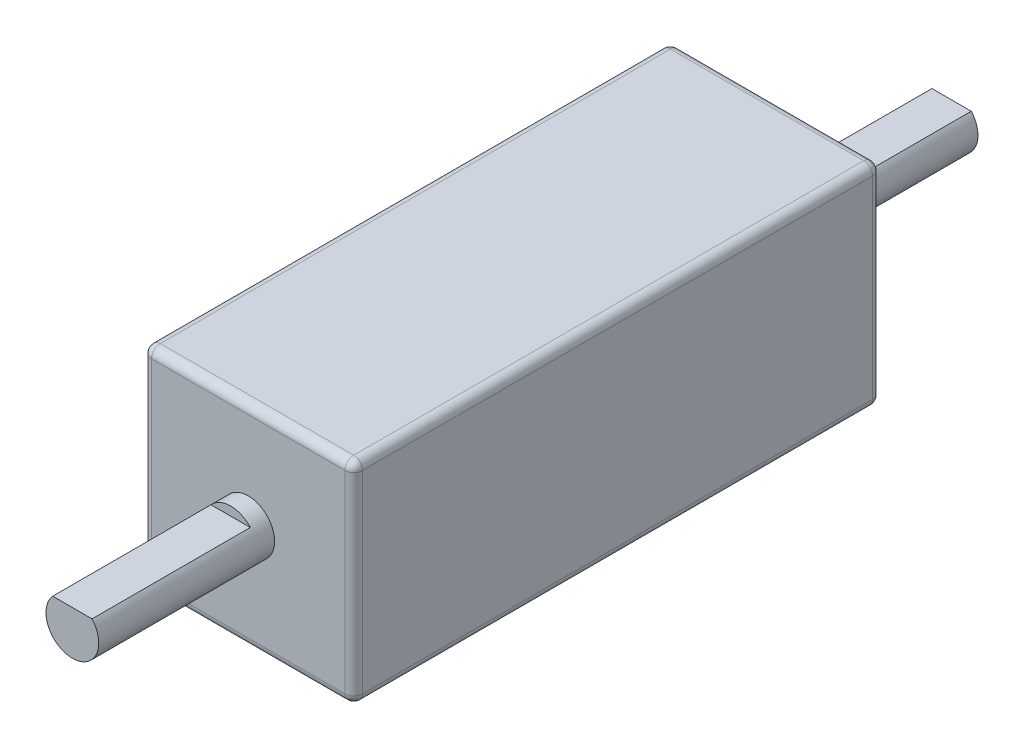
ISO-10303-21;
HEADER;
FILE_DESCRIPTION(('STEP AP214'),'2;1');
FILE_NAME('part.step','',(''),(''),'','','');
FILE_SCHEMA(('AUTOMOTIVE_DESIGN { 1 0 10303 214 1 1 1 1 }'));
ENDSEC;
DATA;
#1=APPLICATION_CONTEXT('core data for automotive mechanical design processes');
#2=APPLICATION_PROTOCOL_DEFINITION('international standard','automotive_design',2000,#1);
#3=PRODUCT_CONTEXT('',#1,'mechanical');
#4=PRODUCT('Part','Part','',(#3));
#5=PRODUCT_RELATED_PRODUCT_CATEGORY('part','',(#4));
#6=PRODUCT_DEFINITION_FORMATION('','',#4);
#7=PRODUCT_DEFINITION_CONTEXT('part definition',#1,'design');
#8=PRODUCT_DEFINITION('design','',#6,#7);
#9=PRODUCT_DEFINITION_SHAPE('','',#8);
#10=(LENGTH_UNIT() NAMED_UNIT(*) SI_UNIT(.MILLI.,.METRE.));
#11=(NAMED_UNIT(*) PLANE_ANGLE_UNIT() SI_UNIT($,.RADIAN.));
#12=(NAMED_UNIT(*) SI_UNIT($,.STERADIAN.) SOLID_ANGLE_UNIT());
#13=UNCERTAINTY_MEASURE_WITH_UNIT(LENGTH_MEASURE(1.E-05),#10,'distance_accuracy_value','');
#14=(GEOMETRIC_REPRESENTATION_CONTEXT(3) GLOBAL_UNCERTAINTY_ASSIGNED_CONTEXT((#13)) GLOBAL_UNIT_ASSIGNED_CONTEXT((#10,
#11,#12)) REPRESENTATION_CONTEXT('',''));
#15=CARTESIAN_POINT('',(0.,0.,0.));
#16=DIRECTION('',(0.,0.,1.));
#17=DIRECTION('',(1.,0.,0.));
#18=AXIS2_PLACEMENT_3D('',#15,#16,#17);
#19=CARTESIAN_POINT('',(0.,0.,-10.));
#20=DIRECTION('',(0.,0.,-1.));
#21=DIRECTION('',(-1.,0.,0.));
#22=AXIS2_PLACEMENT_3D('',#19,#20,#21);
#23=PLANE('',#22);
#24=CARTESIAN_POINT('',(0.,0.,-10.));
#25=DIRECTION('',(0.,0.,-1.));
#26=DIRECTION('',(-1.,0.,0.));
#27=AXIS2_PLACEMENT_3D('',#24,#25,#26);
#28=CIRCLE('',#27,1.5);
#29=CARTESIAN_POINT('',(1.1180339887499,1.,-10.));
#30=VERTEX_POINT('',#29);
#31=CARTESIAN_POINT('',(-1.1180339887499,1.,-10.));
#32=VERTEX_POINT('',#31);
#33=EDGE_CURVE('E156',#30,#32,#28,.T.);
#34=ORIENTED_EDGE('',*,*,#33,.T.);
#35=DIRECTION('',(1.,0.,0.));
#36=VECTOR('',#35,1.);
#37=CARTESIAN_POINT('',(-1.1180339887499,1.,-9.99999999999999));
#38=LINE('',#37,#36);
#39=EDGE_CURVE('E64',#32,#30,#38,.T.);
#40=ORIENTED_EDGE('',*,*,#39,.T.);
#41=EDGE_LOOP('',(#34,#40));
#42=FACE_BOUND('',#41,.T.);
#43=ADVANCED_FACE('F40',(#42),#23,.T.);
#44=CARTESIAN_POINT('',(0.,0.,-10.));
#45=DIRECTION('',(0.,0.,1.));
#46=DIRECTION('',(1.,0.,0.));
#47=AXIS2_PLACEMENT_3D('',#44,#45,#46);
#48=CYLINDRICAL_SURFACE('',#47,1.5);
#49=CARTESIAN_POINT('',(0.,0.,0.));
#50=DIRECTION('',(0.,0.,-1.));
#51=DIRECTION('',(-1.,0.,0.));
#52=AXIS2_PLACEMENT_3D('',#49,#50,#51);
#53=CIRCLE('',#52,1.5);
#54=CARTESIAN_POINT('',(-1.5,0.,0.));
#55=VERTEX_POINT('',#54);
#56=EDGE_CURVE('E170',#55,#55,#53,.T.);
#57=ORIENTED_EDGE('',*,*,#56,.T.);
#58=EDGE_LOOP('',(#57));
#59=FACE_BOUND('',#58,.T.);
#60=DIRECTION('',(0.,0.,1.));
#61=VECTOR('',#60,1.);
#62=CARTESIAN_POINT('',(-1.1180339887499,1.,-89.1268939122205));
#63=LINE('',#62,#61);
#64=CARTESIAN_POINT('',(-1.1180339887499,1.,-1.));
#65=VERTEX_POINT('',#64);
#66=EDGE_CURVE('E159',#32,#65,#63,.T.);
#67=ORIENTED_EDGE('',*,*,#66,.F.);
#68=ORIENTED_EDGE('',*,*,#33,.F.);
#69=DIRECTION('',(0.,0.,1.));
#70=VECTOR('',#69,1.);
#71=CARTESIAN_POINT('',(1.1180339887499,1.,-89.1268939122205));
#72=LINE('',#71,#70);
#73=CARTESIAN_POINT('',(1.1180339887499,1.,-1.));
#74=VERTEX_POINT('',#73);
#75=EDGE_CURVE('E154',#30,#74,#72,.T.);
#76=ORIENTED_EDGE('',*,*,#75,.T.);
#77=CARTESIAN_POINT('',(0.,0.,-1.));
#78=DIRECTION('',(0.,0.,-1.));
#79=DIRECTION('',(-1.,0.,0.));
#80=AXIS2_PLACEMENT_3D('',#77,#78,#79);
#81=CIRCLE('',#80,1.5);
#82=EDGE_CURVE('E57',#65,#74,#81,.T.);
#83=ORIENTED_EDGE('',*,*,#82,.F.);
#84=EDGE_LOOP('',(#67,#68,#76,#83));
#85=FACE_BOUND('',#84,.T.);
#86=ADVANCED_FACE('F155',(#59,#85),#48,.T.);
#87=CARTESIAN_POINT('',(6.,-6.,30.));
#88=DIRECTION('',(-1.,0.,0.));
#89=DIRECTION('',(0.,0.,1.));
#90=AXIS2_PLACEMENT_3D('',#87,#88,#89);
#91=PLANE('',#90);
#92=DIRECTION('',(0.,1.,0.));
#93=VECTOR('',#92,1.);
#94=CARTESIAN_POINT('',(6.,6.,0.5));
#95=LINE('',#94,#93);
#96=CARTESIAN_POINT('',(6.,-5.5,0.5));
#97=VERTEX_POINT('',#96);
#98=CARTESIAN_POINT('',(6.,5.5,0.5));
#99=VERTEX_POINT('',#98);
#100=EDGE_CURVE('E236',#97,#99,#95,.T.);
#101=ORIENTED_EDGE('',*,*,#100,.T.);
#102=DIRECTION('',(0.,0.,-1.));
#103=VECTOR('',#102,1.);
#104=CARTESIAN_POINT('',(6.,5.5,30.));
#105=LINE('',#104,#103);
#106=CARTESIAN_POINT('',(6.,5.5,29.5));
#107=VERTEX_POINT('',#106);
#108=EDGE_CURVE('E239',#99,#107,#105,.F.);
#109=ORIENTED_EDGE('',*,*,#108,.T.);
#110=DIRECTION('',(0.,1.,0.));
#111=VECTOR('',#110,1.);
#112=CARTESIAN_POINT('',(6.,-6.,29.5));
#113=LINE('',#112,#111);
#114=CARTESIAN_POINT('',(6.,-5.5,29.5));
#115=VERTEX_POINT('',#114);
#116=EDGE_CURVE('E234',#107,#115,#113,.F.);
#117=ORIENTED_EDGE('',*,*,#116,.T.);
#118=DIRECTION('',(0.,0.,-1.));
#119=VECTOR('',#118,1.);
#120=CARTESIAN_POINT('',(6.,-5.5,30.));
#121=LINE('',#120,#119);
#122=EDGE_CURVE('E232',#115,#97,#121,.T.);
#123=ORIENTED_EDGE('',*,*,#122,.T.);
#124=EDGE_LOOP('',(#101,#109,#117,#123));
#125=FACE_BOUND('',#124,.T.);
#126=ADVANCED_FACE('F396',(#125),#91,.F.);
#127=CARTESIAN_POINT('',(-6.,6.,30.));
#128=DIRECTION('',(0.,-1.,0.));
#129=DIRECTION('',(0.,0.,-1.));
#130=AXIS2_PLACEMENT_3D('',#127,#128,#129);
#131=PLANE('',#130);
#132=DIRECTION('',(-1.,0.,0.));
#133=VECTOR('',#132,1.);
#134=CARTESIAN_POINT('',(-6.,6.,0.5));
#135=LINE('',#134,#133);
#136=CARTESIAN_POINT('',(5.5,6.,0.5));
#137=VERTEX_POINT('',#136);
#138=CARTESIAN_POINT('',(-5.5,6.,0.5));
#139=VERTEX_POINT('',#138);
#140=EDGE_CURVE('E227',#137,#139,#135,.T.);
#141=ORIENTED_EDGE('',*,*,#140,.T.);
#142=DIRECTION('',(0.,0.,-1.));
#143=VECTOR('',#142,1.);
#144=CARTESIAN_POINT('',(-5.5,6.,30.));
#145=LINE('',#144,#143);
#146=CARTESIAN_POINT('',(-5.5,6.,29.5));
#147=VERTEX_POINT('',#146);
#148=EDGE_CURVE('E230',#139,#147,#145,.F.);
#149=ORIENTED_EDGE('',*,*,#148,.T.);
#150=DIRECTION('',(-1.,0.,0.));
#151=VECTOR('',#150,1.);
#152=CARTESIAN_POINT('',(-6.,6.,29.5));
#153=LINE('',#152,#151);
#154=CARTESIAN_POINT('',(5.5,6.,29.5));
#155=VERTEX_POINT('',#154);
#156=EDGE_CURVE('E225',#147,#155,#153,.F.);
#157=ORIENTED_EDGE('',*,*,#156,.T.);
#158=DIRECTION('',(0.,0.,-1.));
#159=VECTOR('',#158,1.);
#160=CARTESIAN_POINT('',(5.5,6.,30.));
#161=LINE('',#160,#159);
#162=EDGE_CURVE('E223',#155,#137,#161,.T.);
#163=ORIENTED_EDGE('',*,*,#162,.T.);
#164=EDGE_LOOP('',(#141,#149,#157,#163));
#165=FACE_BOUND('',#164,.T.);
#166=ADVANCED_FACE('F361',(#165),#131,.F.);
#167=CARTESIAN_POINT('',(-6.,-6.,30.));
#168=DIRECTION('',(1.,0.,0.));
#169=DIRECTION('',(0.,0.,-1.));
#170=AXIS2_PLACEMENT_3D('',#167,#168,#169);
#171=PLANE('',#170);
#172=DIRECTION('',(0.,-1.,0.));
#173=VECTOR('',#172,1.);
#174=CARTESIAN_POINT('',(-6.,-6.,0.5));
#175=LINE('',#174,#173);
#176=CARTESIAN_POINT('',(-6.,5.5,0.5));
#177=VERTEX_POINT('',#176);
#178=CARTESIAN_POINT('',(-6.,-5.5,0.5));
#179=VERTEX_POINT('',#178);
#180=EDGE_CURVE('E218',#177,#179,#175,.T.);
#181=ORIENTED_EDGE('',*,*,#180,.T.);
#182=DIRECTION('',(0.,0.,-1.));
#183=VECTOR('',#182,1.);
#184=CARTESIAN_POINT('',(-6.,-5.5,30.));
#185=LINE('',#184,#183);
#186=CARTESIAN_POINT('',(-6.,-5.5,29.5));
#187=VERTEX_POINT('',#186);
#188=EDGE_CURVE('E221',#179,#187,#185,.F.);
#189=ORIENTED_EDGE('',*,*,#188,.T.);
#190=DIRECTION('',(0.,-1.,0.));
#191=VECTOR('',#190,1.);
#192=CARTESIAN_POINT('',(-6.,-6.,29.5));
#193=LINE('',#192,#191);
#194=CARTESIAN_POINT('',(-6.,5.5,29.5));
#195=VERTEX_POINT('',#194);
#196=EDGE_CURVE('E216',#187,#195,#193,.F.);
#197=ORIENTED_EDGE('',*,*,#196,.T.);
#198=DIRECTION('',(0.,0.,-1.));
#199=VECTOR('',#198,1.);
#200=CARTESIAN_POINT('',(-6.,5.5,30.));
#201=LINE('',#200,#199);
#202=EDGE_CURVE('E214',#195,#177,#201,.T.);
#203=ORIENTED_EDGE('',*,*,#202,.T.);
#204=EDGE_LOOP('',(#181,#189,#197,#203));
#205=FACE_BOUND('',#204,.T.);
#206=ADVANCED_FACE('F327',(#205),#171,.F.);
#207=CARTESIAN_POINT('',(-6.,-6.,30.));
#208=DIRECTION('',(0.,1.,0.));
#209=DIRECTION('',(0.,0.,1.));
#210=AXIS2_PLACEMENT_3D('',#207,#208,#209);
#211=PLANE('',#210);
#212=DIRECTION('',(1.,0.,0.));
#213=VECTOR('',#212,1.);
#214=CARTESIAN_POINT('',(-6.,-6.,29.5));
#215=LINE('',#214,#213);
#216=CARTESIAN_POINT('',(5.5,-6.,29.5));
#217=VERTEX_POINT('',#216);
#218=CARTESIAN_POINT('',(-5.5,-6.,29.5));
#219=VERTEX_POINT('',#218);
#220=EDGE_CURVE('E198',#217,#219,#215,.F.);
#221=ORIENTED_EDGE('',*,*,#220,.T.);
#222=DIRECTION('',(0.,0.,-1.));
#223=VECTOR('',#222,1.);
#224=CARTESIAN_POINT('',(-5.5,-6.,30.));
#225=LINE('',#224,#223);
#226=CARTESIAN_POINT('',(-5.5,-6.,0.5));
#227=VERTEX_POINT('',#226);
#228=EDGE_CURVE('E203',#219,#227,#225,.T.);
#229=ORIENTED_EDGE('',*,*,#228,.T.);
#230=DIRECTION('',(1.,0.,0.));
#231=VECTOR('',#230,1.);
#232=CARTESIAN_POINT('',(6.,-6.,0.5));
#233=LINE('',#232,#231);
#234=CARTESIAN_POINT('',(5.5,-6.,0.5));
#235=VERTEX_POINT('',#234);
#236=EDGE_CURVE('E200',#227,#235,#233,.T.);
#237=ORIENTED_EDGE('',*,*,#236,.T.);
#238=DIRECTION('',(0.,0.,-1.));
#239=VECTOR('',#238,1.);
#240=CARTESIAN_POINT('',(5.5,-6.,30.));
#241=LINE('',#240,#239);
#242=EDGE_CURVE('E196',#235,#217,#241,.F.);
#243=ORIENTED_EDGE('',*,*,#242,.T.);
#244=EDGE_LOOP('',(#221,#229,#237,#243));
#245=FACE_BOUND('',#244,.T.);
#246=ADVANCED_FACE('F422',(#245),#211,.F.);
#247=CARTESIAN_POINT('',(0.,0.,30.));
#248=DIRECTION('',(0.,0.,-1.));
#249=DIRECTION('',(-1.,0.,0.));
#250=AXIS2_PLACEMENT_3D('',#247,#248,#249);
#251=PLANE('',#250);
#252=DIRECTION('',(1.,0.,0.));
#253=VECTOR('',#252,1.);
#254=CARTESIAN_POINT('',(0.,-5.5,30.));
#255=LINE('',#254,#253);
#256=CARTESIAN_POINT('',(-5.5,-5.5,30.));
#257=VERTEX_POINT('',#256);
#258=CARTESIAN_POINT('',(5.5,-5.5,30.));
#259=VERTEX_POINT('',#258);
#260=EDGE_CURVE('E241',#257,#259,#255,.T.);
#261=ORIENTED_EDGE('',*,*,#260,.T.);
#262=DIRECTION('',(0.,1.,0.));
#263=VECTOR('',#262,1.);
#264=CARTESIAN_POINT('',(5.5,0.,30.));
#265=LINE('',#264,#263);
#266=CARTESIAN_POINT('',(5.5,5.5,30.));
#267=VERTEX_POINT('',#266);
#268=EDGE_CURVE('E11',#259,#267,#265,.T.);
#269=ORIENTED_EDGE('',*,*,#268,.T.);
#270=DIRECTION('',(-1.,0.,0.));
#271=VECTOR('',#270,1.);
#272=CARTESIAN_POINT('',(0.,5.5,30.));
#273=LINE('',#272,#271);
#274=CARTESIAN_POINT('',(-5.5,5.5,30.));
#275=VERTEX_POINT('',#274);
#276=EDGE_CURVE('E49',#267,#275,#273,.T.);
#277=ORIENTED_EDGE('',*,*,#276,.T.);
#278=DIRECTION('',(0.,-1.,0.));
#279=VECTOR('',#278,1.);
#280=CARTESIAN_POINT('',(-5.5,0.,30.));
#281=LINE('',#280,#279);
#282=EDGE_CURVE('E243',#275,#257,#281,.T.);
#283=ORIENTED_EDGE('',*,*,#282,.T.);
#284=EDGE_LOOP('',(#261,#269,#277,#283));
#285=FACE_BOUND('',#284,.T.);
#286=CARTESIAN_POINT('',(0.,0.,30.));
#287=DIRECTION('',(0.,0.,1.));
#288=DIRECTION('',(1.,0.,0.));
#289=AXIS2_PLACEMENT_3D('',#286,#287,#288);
#290=CIRCLE('',#289,1.5);
#291=CARTESIAN_POINT('',(1.5,0.,30.));
#292=VERTEX_POINT('',#291);
#293=EDGE_CURVE('E193',#292,#292,#290,.T.);
#294=ORIENTED_EDGE('',*,*,#293,.F.);
#295=EDGE_LOOP('',(#294));
#296=FACE_BOUND('',#295,.T.);
#297=ADVANCED_FACE('F336',(#285,#296),#251,.F.);
#298=CARTESIAN_POINT('',(0.,0.,0.));
#299=DIRECTION('',(0.,0.,-1.));
#300=DIRECTION('',(-1.,0.,0.));
#301=AXIS2_PLACEMENT_3D('',#298,#299,#300);
#302=PLANE('',#301);
#303=ORIENTED_EDGE('',*,*,#56,.F.);
#304=EDGE_LOOP('',(#303));
#305=FACE_BOUND('',#304,.T.);
#306=DIRECTION('',(0.,1.,0.));
#307=VECTOR('',#306,1.);
#308=CARTESIAN_POINT('',(5.5,-6.,0.));
#309=LINE('',#308,#307);
#310=CARTESIAN_POINT('',(5.5,5.5,0.));
#311=VERTEX_POINT('',#310);
#312=CARTESIAN_POINT('',(5.5,-5.5,0.));
#313=VERTEX_POINT('',#312);
#314=EDGE_CURVE('E205',#311,#313,#309,.F.);
#315=ORIENTED_EDGE('',*,*,#314,.T.);
#316=DIRECTION('',(1.,0.,0.));
#317=VECTOR('',#316,1.);
#318=CARTESIAN_POINT('',(-6.,-5.5,0.));
#319=LINE('',#318,#317);
#320=CARTESIAN_POINT('',(-5.5,-5.5,0.));
#321=VERTEX_POINT('',#320);
#322=EDGE_CURVE('E211',#313,#321,#319,.F.);
#323=ORIENTED_EDGE('',*,*,#322,.T.);
#324=DIRECTION('',(0.,-1.,0.));
#325=VECTOR('',#324,1.);
#326=CARTESIAN_POINT('',(-5.5,6.,0.));
#327=LINE('',#326,#325);
#328=CARTESIAN_POINT('',(-5.5,5.5,0.));
#329=VERTEX_POINT('',#328);
#330=EDGE_CURVE('E209',#321,#329,#327,.F.);
#331=ORIENTED_EDGE('',*,*,#330,.T.);
#332=DIRECTION('',(-1.,0.,0.));
#333=VECTOR('',#332,1.);
#334=CARTESIAN_POINT('',(6.,5.5,0.));
#335=LINE('',#334,#333);
#336=EDGE_CURVE('E207',#329,#311,#335,.F.);
#337=ORIENTED_EDGE('',*,*,#336,.T.);
#338=EDGE_LOOP('',(#315,#323,#331,#337));
#339=FACE_BOUND('',#338,.T.);
#340=ADVANCED_FACE('F418',(#305,#339),#302,.T.);
#341=CARTESIAN_POINT('',(0.,0.,40.));
#342=DIRECTION('',(0.,0.,-1.));
#343=DIRECTION('',(-1.,0.,0.));
#344=AXIS2_PLACEMENT_3D('',#341,#342,#343);
#345=CYLINDRICAL_SURFACE('',#344,1.5);
#346=CARTESIAN_POINT('',(0.,0.,40.));
#347=DIRECTION('',(0.,0.,1.));
#348=DIRECTION('',(1.,0.,0.));
#349=AXIS2_PLACEMENT_3D('',#346,#347,#348);
#350=CIRCLE('',#349,1.5);
#351=CARTESIAN_POINT('',(-1.1180339887499,1.,40.));
#352=VERTEX_POINT('',#351);
#353=CARTESIAN_POINT('',(1.1180339887499,1.,40.));
#354=VERTEX_POINT('',#353);
#355=EDGE_CURVE('E190',#352,#354,#350,.T.);
#356=ORIENTED_EDGE('',*,*,#355,.F.);
#357=DIRECTION('',(0.,0.,-1.));
#358=VECTOR('',#357,1.);
#359=CARTESIAN_POINT('',(-1.1180339887499,1.,143.688902456001));
#360=LINE('',#359,#358);
#361=CARTESIAN_POINT('',(-1.1180339887499,1.,31.));
#362=VERTEX_POINT('',#361);
#363=EDGE_CURVE('E182',#352,#362,#360,.T.);
#364=ORIENTED_EDGE('',*,*,#363,.T.);
#365=CARTESIAN_POINT('',(0.,0.,31.));
#366=DIRECTION('',(0.,0.,1.));
#367=DIRECTION('',(1.,0.,0.));
#368=AXIS2_PLACEMENT_3D('',#365,#366,#367);
#369=CIRCLE('',#368,1.5);
#370=CARTESIAN_POINT('',(1.1180339887499,1.,31.));
#371=VERTEX_POINT('',#370);
#372=EDGE_CURVE('E173',#371,#362,#369,.T.);
#373=ORIENTED_EDGE('',*,*,#372,.F.);
#374=DIRECTION('',(0.,0.,-1.));
#375=VECTOR('',#374,1.);
#376=CARTESIAN_POINT('',(1.1180339887499,1.,143.688902456001));
#377=LINE('',#376,#375);
#378=EDGE_CURVE('E179',#354,#371,#377,.T.);
#379=ORIENTED_EDGE('',*,*,#378,.F.);
#380=EDGE_LOOP('',(#356,#364,#373,#379));
#381=FACE_BOUND('',#380,.T.);
#382=ORIENTED_EDGE('',*,*,#293,.T.);
#383=EDGE_LOOP('',(#382));
#384=FACE_BOUND('',#383,.T.);
#385=ADVANCED_FACE('F414',(#381,#384),#345,.T.);
#386=CARTESIAN_POINT('',(0.,0.,40.));
#387=DIRECTION('',(0.,0.,1.));
#388=DIRECTION('',(1.,0.,0.));
#389=AXIS2_PLACEMENT_3D('',#386,#387,#388);
#390=PLANE('',#389);
#391=DIRECTION('',(1.,0.,0.));
#392=VECTOR('',#391,1.);
#393=CARTESIAN_POINT('',(-1.1180339887499,1.,40.));
#394=LINE('',#393,#392);
#395=EDGE_CURVE('E184',#352,#354,#394,.T.);
#396=ORIENTED_EDGE('',*,*,#395,.F.);
#397=ORIENTED_EDGE('',*,*,#355,.T.);
#398=EDGE_LOOP('',(#396,#397));
#399=FACE_BOUND('',#398,.T.);
#400=ADVANCED_FACE('F411',(#399),#390,.T.);
#401=CARTESIAN_POINT('',(0.,5.5,29.5));
#402=DIRECTION('',(-1.,0.,0.));
#403=DIRECTION('',(0.,0.,1.));
#404=AXIS2_PLACEMENT_3D('',#401,#402,#403);
#405=CYLINDRICAL_SURFACE('',#404,0.5);
#406=CARTESIAN_POINT('',(-5.5,5.5,29.5));
#407=DIRECTION('',(-1.,0.,0.));
#408=DIRECTION('',(0.,0.,1.));
#409=AXIS2_PLACEMENT_3D('',#406,#407,#408);
#410=CIRCLE('',#409,0.5);
#411=EDGE_CURVE('E44',#275,#147,#410,.T.);
#412=ORIENTED_EDGE('',*,*,#411,.F.);
#413=ORIENTED_EDGE('',*,*,#276,.F.);
#414=CARTESIAN_POINT('',(5.5,5.5,29.5));
#415=DIRECTION('',(1.,0.,0.));
#416=DIRECTION('',(0.,0.,-1.));
#417=AXIS2_PLACEMENT_3D('',#414,#415,#416);
#418=CIRCLE('',#417,0.5);
#419=EDGE_CURVE('E304',#155,#267,#418,.T.);
#420=ORIENTED_EDGE('',*,*,#419,.F.);
#421=ORIENTED_EDGE('',*,*,#156,.F.);
#422=EDGE_LOOP('',(#412,#413,#420,#421));
#423=FACE_BOUND('',#422,.T.);
#424=ADVANCED_FACE('F42',(#423),#405,.T.);
#425=CARTESIAN_POINT('',(-5.5,5.5,29.5));
#426=DIRECTION('',(0.,1.,0.));
#427=DIRECTION('',(0.,0.,1.));
#428=AXIS2_PLACEMENT_3D('',#425,#426,#427);
#429=SPHERICAL_SURFACE('',#428,0.5);
#430=CARTESIAN_POINT('',(-5.5,5.5,29.5));
#431=DIRECTION('',(0.,1.,0.));
#432=DIRECTION('',(0.,0.,1.));
#433=AXIS2_PLACEMENT_3D('',#430,#431,#432);
#434=CIRCLE('',#433,0.5);
#435=EDGE_CURVE('E299',#275,#195,#434,.F.);
#436=ORIENTED_EDGE('',*,*,#435,.F.);
#437=ORIENTED_EDGE('',*,*,#411,.T.);
#438=CARTESIAN_POINT('',(-5.5,5.5,29.5));
#439=DIRECTION('',(0.,0.,1.));
#440=DIRECTION('',(1.,0.,0.));
#441=AXIS2_PLACEMENT_3D('',#438,#439,#440);
#442=CIRCLE('',#441,0.5);
#443=EDGE_CURVE('E302',#195,#147,#442,.F.);
#444=ORIENTED_EDGE('',*,*,#443,.F.);
#445=EDGE_LOOP('',(#436,#437,#444));
#446=FACE_BOUND('',#445,.T.);
#447=ADVANCED_FACE('F316',(#446),#429,.T.);
#448=CARTESIAN_POINT('',(5.5,5.5,29.5));
#449=DIRECTION('',(0.,0.,1.));
#450=DIRECTION('',(1.,0.,0.));
#451=AXIS2_PLACEMENT_3D('',#448,#449,#450);
#452=SPHERICAL_SURFACE('',#451,0.5);
#453=CARTESIAN_POINT('',(5.5,5.5,29.5));
#454=DIRECTION('',(0.,0.,1.));
#455=DIRECTION('',(1.,0.,0.));
#456=AXIS2_PLACEMENT_3D('',#453,#454,#455);
#457=CIRCLE('',#456,0.5);
#458=EDGE_CURVE('E294',#155,#107,#457,.F.);
#459=ORIENTED_EDGE('',*,*,#458,.F.);
#460=ORIENTED_EDGE('',*,*,#419,.T.);
#461=CARTESIAN_POINT('',(5.5,5.5,29.5));
#462=DIRECTION('',(0.,1.,0.));
#463=DIRECTION('',(0.,0.,1.));
#464=AXIS2_PLACEMENT_3D('',#461,#462,#463);
#465=CIRCLE('',#464,0.5);
#466=EDGE_CURVE('E297',#107,#267,#465,.F.);
#467=ORIENTED_EDGE('',*,*,#466,.F.);
#468=EDGE_LOOP('',(#459,#460,#467));
#469=FACE_BOUND('',#468,.T.);
#470=ADVANCED_FACE('F353',(#469),#452,.T.);
#471=CARTESIAN_POINT('',(-5.5,5.5,30.));
#472=DIRECTION('',(0.,0.,-1.));
#473=DIRECTION('',(-1.,0.,0.));
#474=AXIS2_PLACEMENT_3D('',#471,#472,#473);
#475=CYLINDRICAL_SURFACE('',#474,0.5);
#476=ORIENTED_EDGE('',*,*,#443,.T.);
#477=ORIENTED_EDGE('',*,*,#148,.F.);
#478=CARTESIAN_POINT('',(-5.5,5.5,0.5));
#479=DIRECTION('',(0.,0.,-1.));
#480=DIRECTION('',(-1.,0.,0.));
#481=AXIS2_PLACEMENT_3D('',#478,#479,#480);
#482=CIRCLE('',#481,0.5);
#483=EDGE_CURVE('E289',#177,#139,#482,.T.);
#484=ORIENTED_EDGE('',*,*,#483,.F.);
#485=ORIENTED_EDGE('',*,*,#202,.F.);
#486=EDGE_LOOP('',(#476,#477,#484,#485));
#487=FACE_BOUND('',#486,.T.);
#488=ADVANCED_FACE('F323',(#487),#475,.T.);
#489=CARTESIAN_POINT('',(-5.5,0.,29.5));
#490=DIRECTION('',(0.,-1.,0.));
#491=DIRECTION('',(0.,0.,-1.));
#492=AXIS2_PLACEMENT_3D('',#489,#490,#491);
#493=CYLINDRICAL_SURFACE('',#492,0.5);
#494=ORIENTED_EDGE('',*,*,#435,.T.);
#495=ORIENTED_EDGE('',*,*,#196,.F.);
#496=CARTESIAN_POINT('',(-5.5,-5.5,29.5));
#497=DIRECTION('',(0.,-1.,0.));
#498=DIRECTION('',(0.,0.,-1.));
#499=AXIS2_PLACEMENT_3D('',#496,#497,#498);
#500=CIRCLE('',#499,0.5);
#501=EDGE_CURVE('E286',#257,#187,#500,.T.);
#502=ORIENTED_EDGE('',*,*,#501,.F.);
#503=ORIENTED_EDGE('',*,*,#282,.F.);
#504=EDGE_LOOP('',(#494,#495,#502,#503));
#505=FACE_BOUND('',#504,.T.);
#506=ADVANCED_FACE('F333',(#505),#493,.T.);
#507=CARTESIAN_POINT('',(0.,-5.5,29.5));
#508=DIRECTION('',(1.,0.,0.));
#509=DIRECTION('',(0.,0.,-1.));
#510=AXIS2_PLACEMENT_3D('',#507,#508,#509);
#511=CYLINDRICAL_SURFACE('',#510,0.5);
#512=CARTESIAN_POINT('',(5.5,-5.5,29.5));
#513=DIRECTION('',(1.,0.,0.));
#514=DIRECTION('',(0.,0.,-1.));
#515=AXIS2_PLACEMENT_3D('',#512,#513,#514);
#516=CIRCLE('',#515,0.5);
#517=EDGE_CURVE('E280',#259,#217,#516,.T.);
#518=ORIENTED_EDGE('',*,*,#517,.F.);
#519=ORIENTED_EDGE('',*,*,#260,.F.);
#520=CARTESIAN_POINT('',(-5.5,-5.5,29.5));
#521=DIRECTION('',(-1.,0.,0.));
#522=DIRECTION('',(0.,0.,1.));
#523=AXIS2_PLACEMENT_3D('',#520,#521,#522);
#524=CIRCLE('',#523,0.5);
#525=EDGE_CURVE('E283',#219,#257,#524,.T.);
#526=ORIENTED_EDGE('',*,*,#525,.F.);
#527=ORIENTED_EDGE('',*,*,#220,.F.);
#528=EDGE_LOOP('',(#518,#519,#526,#527));
#529=FACE_BOUND('',#528,.T.);
#530=ADVANCED_FACE('F342',(#529),#511,.T.);
#531=CARTESIAN_POINT('',(5.5,0.,29.5));
#532=DIRECTION('',(0.,1.,0.));
#533=DIRECTION('',(0.,0.,1.));
#534=AXIS2_PLACEMENT_3D('',#531,#532,#533);
#535=CYLINDRICAL_SURFACE('',#534,0.5);
#536=ORIENTED_EDGE('',*,*,#466,.T.);
#537=ORIENTED_EDGE('',*,*,#268,.F.);
#538=CARTESIAN_POINT('',(5.5,-5.5,29.5));
#539=DIRECTION('',(0.,-1.,0.));
#540=DIRECTION('',(0.,0.,-1.));
#541=AXIS2_PLACEMENT_3D('',#538,#539,#540);
#542=CIRCLE('',#541,0.5);
#543=EDGE_CURVE('E277',#115,#259,#542,.T.);
#544=ORIENTED_EDGE('',*,*,#543,.F.);
#545=ORIENTED_EDGE('',*,*,#116,.F.);
#546=EDGE_LOOP('',(#536,#537,#544,#545));
#547=FACE_BOUND('',#546,.T.);
#548=ADVANCED_FACE('F352',(#547),#535,.T.);
#549=CARTESIAN_POINT('',(5.5,5.5,30.));
#550=DIRECTION('',(0.,0.,-1.));
#551=DIRECTION('',(-1.,0.,0.));
#552=AXIS2_PLACEMENT_3D('',#549,#550,#551);
#553=CYLINDRICAL_SURFACE('',#552,0.5);
#554=ORIENTED_EDGE('',*,*,#458,.T.);
#555=ORIENTED_EDGE('',*,*,#108,.F.);
#556=CARTESIAN_POINT('',(5.5,5.5,0.5));
#557=DIRECTION('',(0.,0.,-1.));
#558=DIRECTION('',(-1.,0.,0.));
#559=AXIS2_PLACEMENT_3D('',#556,#557,#558);
#560=CIRCLE('',#559,0.5);
#561=EDGE_CURVE('E274',#137,#99,#560,.T.);
#562=ORIENTED_EDGE('',*,*,#561,.F.);
#563=ORIENTED_EDGE('',*,*,#162,.F.);
#564=EDGE_LOOP('',(#554,#555,#562,#563));
#565=FACE_BOUND('',#564,.T.);
#566=ADVANCED_FACE('F358',(#565),#553,.T.);
#567=CARTESIAN_POINT('',(-6.,5.5,0.5));
#568=DIRECTION('',(1.,0.,0.));
#569=DIRECTION('',(0.,0.,-1.));
#570=AXIS2_PLACEMENT_3D('',#567,#568,#569);
#571=CYLINDRICAL_SURFACE('',#570,0.5);
#572=CARTESIAN_POINT('',(-5.5,5.5,0.5));
#573=DIRECTION('',(-1.,0.,0.));
#574=DIRECTION('',(0.,0.,1.));
#575=AXIS2_PLACEMENT_3D('',#572,#573,#574);
#576=CIRCLE('',#575,0.5);
#577=EDGE_CURVE('E291',#139,#329,#576,.T.);
#578=ORIENTED_EDGE('',*,*,#577,.F.);
#579=ORIENTED_EDGE('',*,*,#140,.F.);
#580=CARTESIAN_POINT('',(5.5,5.5,0.5));
#581=DIRECTION('',(1.,0.,0.));
#582=DIRECTION('',(0.,0.,-1.));
#583=AXIS2_PLACEMENT_3D('',#580,#581,#582);
#584=CIRCLE('',#583,0.5);
#585=EDGE_CURVE('E271',#311,#137,#584,.T.);
#586=ORIENTED_EDGE('',*,*,#585,.F.);
#587=ORIENTED_EDGE('',*,*,#336,.F.);
#588=EDGE_LOOP('',(#578,#579,#586,#587));
#589=FACE_BOUND('',#588,.T.);
#590=ADVANCED_FACE('F365',(#589),#571,.T.);
#591=CARTESIAN_POINT('',(-5.5,5.5,0.5));
#592=DIRECTION('',(0.,1.,0.));
#593=DIRECTION('',(0.,0.,1.));
#594=AXIS2_PLACEMENT_3D('',#591,#592,#593);
#595=SPHERICAL_SURFACE('',#594,0.5);
#596=ORIENTED_EDGE('',*,*,#483,.T.);
#597=ORIENTED_EDGE('',*,*,#577,.T.);
#598=CARTESIAN_POINT('',(-5.5,5.5,0.5));
#599=DIRECTION('',(0.,1.,0.));
#600=DIRECTION('',(0.,0.,1.));
#601=AXIS2_PLACEMENT_3D('',#598,#599,#600);
#602=CIRCLE('',#601,0.5);
#603=EDGE_CURVE('E268',#177,#329,#602,.F.);
#604=ORIENTED_EDGE('',*,*,#603,.F.);
#605=EDGE_LOOP('',(#596,#597,#604));
#606=FACE_BOUND('',#605,.T.);
#607=ADVANCED_FACE('F369',(#606),#595,.T.);
#608=CARTESIAN_POINT('',(-5.5,-5.5,29.5));
#609=DIRECTION('',(0.,0.,1.));
#610=DIRECTION('',(1.,0.,0.));
#611=AXIS2_PLACEMENT_3D('',#608,#609,#610);
#612=SPHERICAL_SURFACE('',#611,0.5);
#613=ORIENTED_EDGE('',*,*,#525,.T.);
#614=ORIENTED_EDGE('',*,*,#501,.T.);
#615=CARTESIAN_POINT('',(-5.5,-5.5,29.5));
#616=DIRECTION('',(0.,0.,1.));
#617=DIRECTION('',(1.,0.,0.));
#618=AXIS2_PLACEMENT_3D('',#615,#616,#617);
#619=CIRCLE('',#618,0.5);
#620=EDGE_CURVE('E265',#219,#187,#619,.F.);
#621=ORIENTED_EDGE('',*,*,#620,.F.);
#622=EDGE_LOOP('',(#613,#614,#621));
#623=FACE_BOUND('',#622,.T.);
#624=ADVANCED_FACE('F381',(#623),#612,.T.);
#625=CARTESIAN_POINT('',(5.5,-5.5,29.5));
#626=DIRECTION('',(0.,0.,1.));
#627=DIRECTION('',(1.,0.,0.));
#628=AXIS2_PLACEMENT_3D('',#625,#626,#627);
#629=SPHERICAL_SURFACE('',#628,0.5);
#630=ORIENTED_EDGE('',*,*,#543,.T.);
#631=ORIENTED_EDGE('',*,*,#517,.T.);
#632=CARTESIAN_POINT('',(5.5,-5.5,29.5));
#633=DIRECTION('',(0.,0.,1.));
#634=DIRECTION('',(1.,0.,0.));
#635=AXIS2_PLACEMENT_3D('',#632,#633,#634);
#636=CIRCLE('',#635,0.5);
#637=EDGE_CURVE('E262',#115,#217,#636,.F.);
#638=ORIENTED_EDGE('',*,*,#637,.F.);
#639=EDGE_LOOP('',(#630,#631,#638));
#640=FACE_BOUND('',#639,.T.);
#641=ADVANCED_FACE('F348',(#640),#629,.T.);
#642=CARTESIAN_POINT('',(5.5,5.5,0.5));
#643=DIRECTION('',(0.,1.,0.));
#644=DIRECTION('',(0.,0.,1.));
#645=AXIS2_PLACEMENT_3D('',#642,#643,#644);
#646=SPHERICAL_SURFACE('',#645,0.5);
#647=ORIENTED_EDGE('',*,*,#585,.T.);
#648=ORIENTED_EDGE('',*,*,#561,.T.);
#649=CARTESIAN_POINT('',(5.5,5.5,0.5));
#650=DIRECTION('',(0.,1.,0.));
#651=DIRECTION('',(0.,0.,1.));
#652=AXIS2_PLACEMENT_3D('',#649,#650,#651);
#653=CIRCLE('',#652,0.5);
#654=EDGE_CURVE('E260',#311,#99,#653,.F.);
#655=ORIENTED_EDGE('',*,*,#654,.F.);
#656=EDGE_LOOP('',(#647,#648,#655));
#657=FACE_BOUND('',#656,.T.);
#658=ADVANCED_FACE('F388',(#657),#646,.T.);
#659=CARTESIAN_POINT('',(-5.5,-6.,0.5));
#660=DIRECTION('',(0.,1.,0.));
#661=DIRECTION('',(0.,0.,1.));
#662=AXIS2_PLACEMENT_3D('',#659,#660,#661);
#663=CYLINDRICAL_SURFACE('',#662,0.5);
#664=ORIENTED_EDGE('',*,*,#603,.T.);
#665=ORIENTED_EDGE('',*,*,#330,.F.);
#666=CARTESIAN_POINT('',(-5.5,-5.5,0.5));
#667=DIRECTION('',(0.,-1.,0.));
#668=DIRECTION('',(0.,0.,-1.));
#669=AXIS2_PLACEMENT_3D('',#666,#667,#668);
#670=CIRCLE('',#669,0.5);
#671=EDGE_CURVE('E257',#179,#321,#670,.T.);
#672=ORIENTED_EDGE('',*,*,#671,.F.);
#673=ORIENTED_EDGE('',*,*,#180,.F.);
#674=EDGE_LOOP('',(#664,#665,#672,#673));
#675=FACE_BOUND('',#674,.T.);
#676=ADVANCED_FACE('F372',(#675),#663,.T.);
#677=CARTESIAN_POINT('',(-5.5,-5.5,30.));
#678=DIRECTION('',(0.,0.,-1.));
#679=DIRECTION('',(-1.,0.,0.));
#680=AXIS2_PLACEMENT_3D('',#677,#678,#679);
#681=CYLINDRICAL_SURFACE('',#680,0.5);
#682=ORIENTED_EDGE('',*,*,#620,.T.);
#683=ORIENTED_EDGE('',*,*,#188,.F.);
#684=CARTESIAN_POINT('',(-5.5,-5.5,0.5));
#685=DIRECTION('',(0.,0.,-1.));
#686=DIRECTION('',(-1.,0.,0.));
#687=AXIS2_PLACEMENT_3D('',#684,#685,#686);
#688=CIRCLE('',#687,0.5);
#689=EDGE_CURVE('E255',#227,#179,#688,.T.);
#690=ORIENTED_EDGE('',*,*,#689,.F.);
#691=ORIENTED_EDGE('',*,*,#228,.F.);
#692=EDGE_LOOP('',(#682,#683,#690,#691));
#693=FACE_BOUND('',#692,.T.);
#694=ADVANCED_FACE('F378',(#693),#681,.T.);
#695=CARTESIAN_POINT('',(5.5,-5.5,30.));
#696=DIRECTION('',(0.,0.,-1.));
#697=DIRECTION('',(-1.,0.,0.));
#698=AXIS2_PLACEMENT_3D('',#695,#696,#697);
#699=CYLINDRICAL_SURFACE('',#698,0.5);
#700=ORIENTED_EDGE('',*,*,#637,.T.);
#701=ORIENTED_EDGE('',*,*,#242,.F.);
#702=CARTESIAN_POINT('',(5.5,-5.5,0.5));
#703=DIRECTION('',(0.,0.,-1.));
#704=DIRECTION('',(-1.,0.,0.));
#705=AXIS2_PLACEMENT_3D('',#702,#703,#704);
#706=CIRCLE('',#705,0.5);
#707=EDGE_CURVE('E252',#97,#235,#706,.T.);
#708=ORIENTED_EDGE('',*,*,#707,.F.);
#709=ORIENTED_EDGE('',*,*,#122,.F.);
#710=EDGE_LOOP('',(#700,#701,#708,#709));
#711=FACE_BOUND('',#710,.T.);
#712=ADVANCED_FACE('F449',(#711),#699,.T.);
#713=CARTESIAN_POINT('',(5.5,-6.,0.5));
#714=DIRECTION('',(0.,-1.,0.));
#715=DIRECTION('',(0.,0.,-1.));
#716=AXIS2_PLACEMENT_3D('',#713,#714,#715);
#717=CYLINDRICAL_SURFACE('',#716,0.5);
#718=ORIENTED_EDGE('',*,*,#654,.T.);
#719=ORIENTED_EDGE('',*,*,#100,.F.);
#720=CARTESIAN_POINT('',(5.5,-5.5,0.5));
#721=DIRECTION('',(0.,-1.,0.));
#722=DIRECTION('',(0.,0.,-1.));
#723=AXIS2_PLACEMENT_3D('',#720,#721,#722);
#724=CIRCLE('',#723,0.5);
#725=EDGE_CURVE('E249',#313,#97,#724,.T.);
#726=ORIENTED_EDGE('',*,*,#725,.F.);
#727=ORIENTED_EDGE('',*,*,#314,.F.);
#728=EDGE_LOOP('',(#718,#719,#726,#727));
#729=FACE_BOUND('',#728,.T.);
#730=ADVANCED_FACE('F446',(#729),#717,.T.);
#731=CARTESIAN_POINT('',(-5.5,-5.5,0.5));
#732=DIRECTION('',(-1.,0.,0.));
#733=DIRECTION('',(0.,0.,1.));
#734=AXIS2_PLACEMENT_3D('',#731,#732,#733);
#735=SPHERICAL_SURFACE('',#734,0.5);
#736=ORIENTED_EDGE('',*,*,#689,.T.);
#737=ORIENTED_EDGE('',*,*,#671,.T.);
#738=CARTESIAN_POINT('',(-5.5,-5.5,0.5));
#739=DIRECTION('',(-1.,0.,0.));
#740=DIRECTION('',(0.,0.,1.));
#741=AXIS2_PLACEMENT_3D('',#738,#739,#740);
#742=CIRCLE('',#741,0.5);
#743=EDGE_CURVE('E247',#227,#321,#742,.F.);
#744=ORIENTED_EDGE('',*,*,#743,.F.);
#745=EDGE_LOOP('',(#736,#737,#744));
#746=FACE_BOUND('',#745,.T.);
#747=ADVANCED_FACE('F442',(#746),#735,.T.);
#748=CARTESIAN_POINT('',(5.5,-5.5,0.5));
#749=DIRECTION('',(1.,0.,0.));
#750=DIRECTION('',(0.,0.,-1.));
#751=AXIS2_PLACEMENT_3D('',#748,#749,#750);
#752=SPHERICAL_SURFACE('',#751,0.5);
#753=ORIENTED_EDGE('',*,*,#725,.T.);
#754=ORIENTED_EDGE('',*,*,#707,.T.);
#755=CARTESIAN_POINT('',(5.5,-5.5,0.5));
#756=DIRECTION('',(1.,0.,0.));
#757=DIRECTION('',(0.,0.,-1.));
#758=AXIS2_PLACEMENT_3D('',#755,#756,#757);
#759=CIRCLE('',#758,0.5);
#760=EDGE_CURVE('E187',#313,#235,#759,.F.);
#761=ORIENTED_EDGE('',*,*,#760,.F.);
#762=EDGE_LOOP('',(#753,#754,#761));
#763=FACE_BOUND('',#762,.T.);
#764=ADVANCED_FACE('F438',(#763),#752,.T.);
#765=CARTESIAN_POINT('',(-6.,-5.5,0.5));
#766=DIRECTION('',(-1.,0.,0.));
#767=DIRECTION('',(0.,0.,1.));
#768=AXIS2_PLACEMENT_3D('',#765,#766,#767);
#769=CYLINDRICAL_SURFACE('',#768,0.5);
#770=ORIENTED_EDGE('',*,*,#743,.T.);
#771=ORIENTED_EDGE('',*,*,#322,.F.);
#772=ORIENTED_EDGE('',*,*,#760,.T.);
#773=ORIENTED_EDGE('',*,*,#236,.F.);
#774=EDGE_LOOP('',(#770,#771,#772,#773));
#775=FACE_BOUND('',#774,.T.);
#776=ADVANCED_FACE('F406',(#775),#769,.T.);
#777=CARTESIAN_POINT('',(-1.1180339887499,1.,143.688902456001));
#778=DIRECTION('',(0.,1.,0.));
#779=DIRECTION('',(0.,0.,1.));
#780=AXIS2_PLACEMENT_3D('',#777,#778,#779);
#781=PLANE('',#780);
#782=ORIENTED_EDGE('',*,*,#363,.F.);
#783=ORIENTED_EDGE('',*,*,#395,.T.);
#784=ORIENTED_EDGE('',*,*,#378,.T.);
#785=DIRECTION('',(1.,0.,0.));
#786=VECTOR('',#785,1.);
#787=CARTESIAN_POINT('',(-1.1180339887499,1.,31.));
#788=LINE('',#787,#786);
#789=EDGE_CURVE('E176',#362,#371,#788,.T.);
#790=ORIENTED_EDGE('',*,*,#789,.F.);
#791=EDGE_LOOP('',(#782,#783,#784,#790));
#792=FACE_BOUND('',#791,.T.);
#793=ADVANCED_FACE('F402',(#792),#781,.T.);
#794=CARTESIAN_POINT('',(0.,0.,31.));
#795=DIRECTION('',(0.,0.,1.));
#796=DIRECTION('',(1.,0.,0.));
#797=AXIS2_PLACEMENT_3D('',#794,#795,#796);
#798=PLANE('',#797);
#799=ORIENTED_EDGE('',*,*,#789,.T.);
#800=ORIENTED_EDGE('',*,*,#372,.T.);
#801=EDGE_LOOP('',(#799,#800));
#802=FACE_BOUND('',#801,.T.);
#803=ADVANCED_FACE('F405',(#802),#798,.T.);
#804=CARTESIAN_POINT('',(-1.1180339887499,1.,-89.1268939122205));
#805=DIRECTION('',(0.,-1.,0.));
#806=DIRECTION('',(0.,0.,-1.));
#807=AXIS2_PLACEMENT_3D('',#804,#805,#806);
#808=PLANE('',#807);
#809=ORIENTED_EDGE('',*,*,#66,.T.);
#810=DIRECTION('',(1.,0.,0.));
#811=VECTOR('',#810,1.);
#812=CARTESIAN_POINT('',(-1.1180339887499,1.,-1.));
#813=LINE('',#812,#811);
#814=EDGE_CURVE('E160',#65,#74,#813,.T.);
#815=ORIENTED_EDGE('',*,*,#814,.T.);
#816=ORIENTED_EDGE('',*,*,#75,.F.);
#817=ORIENTED_EDGE('',*,*,#39,.F.);
#818=EDGE_LOOP('',(#809,#815,#816,#817));
#819=FACE_BOUND('',#818,.T.);
#820=ADVANCED_FACE('F166',(#819),#808,.F.);
#821=CARTESIAN_POINT('',(0.,0.,-1.));
#822=DIRECTION('',(0.,0.,-1.));
#823=DIRECTION('',(-1.,0.,0.));
#824=AXIS2_PLACEMENT_3D('',#821,#822,#823);
#825=PLANE('',#824);
#826=ORIENTED_EDGE('',*,*,#82,.T.);
#827=ORIENTED_EDGE('',*,*,#814,.F.);
#828=EDGE_LOOP('',(#826,#827));
#829=FACE_BOUND('',#828,.T.);
#830=ADVANCED_FACE('F163',(#829),#825,.T.);
#831=CLOSED_SHELL('',(#43,#86,#126,#166,#206,#246,#297,#340,#385,#400,#424,#447,#470,#488,#506,
#530,#548,#566,#590,#607,#624,#641,#658,#676,#694,#712,#730,#747,#764,#776,#793,#803,#820,#830));
#832=MANIFOLD_SOLID_BREP('B2',#831);
#833=ADVANCED_BREP_SHAPE_REPRESENTATION('',(#18,#832),#14);
#834=SHAPE_DEFINITION_REPRESENTATION(#9,#833);
ENDSEC;
END-ISO-10303-21;
